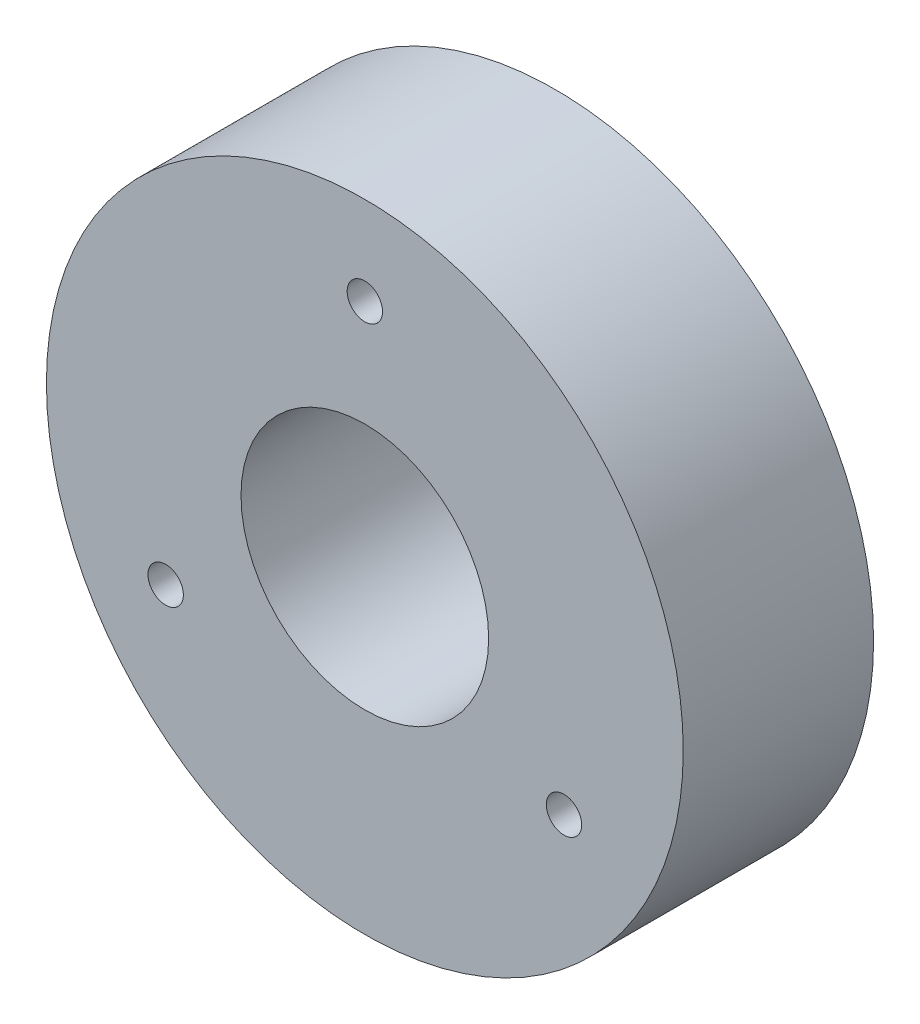
ISO-10303-21;
HEADER;
FILE_DESCRIPTION(('STEP AP214'),'2;1');
FILE_NAME('part.step','',(''),(''),'','','');
FILE_SCHEMA(('AUTOMOTIVE_DESIGN { 1 0 10303 214 1 1 1 1 }'));
ENDSEC;
DATA;
#1=APPLICATION_CONTEXT('core data for automotive mechanical design processes');
#2=APPLICATION_PROTOCOL_DEFINITION('international standard','automotive_design',2000,#1);
#3=PRODUCT_CONTEXT('',#1,'mechanical');
#4=PRODUCT('Part','Part','',(#3));
#5=PRODUCT_RELATED_PRODUCT_CATEGORY('part','',(#4));
#6=PRODUCT_DEFINITION_FORMATION('','',#4);
#7=PRODUCT_DEFINITION_CONTEXT('part definition',#1,'design');
#8=PRODUCT_DEFINITION('design','',#6,#7);
#9=PRODUCT_DEFINITION_SHAPE('','',#8);
#10=(LENGTH_UNIT() NAMED_UNIT(*) SI_UNIT(.MILLI.,.METRE.));
#11=(NAMED_UNIT(*) PLANE_ANGLE_UNIT() SI_UNIT($,.RADIAN.));
#12=(NAMED_UNIT(*) SI_UNIT($,.STERADIAN.) SOLID_ANGLE_UNIT());
#13=UNCERTAINTY_MEASURE_WITH_UNIT(LENGTH_MEASURE(1.E-05),#10,'distance_accuracy_value','');
#14=(GEOMETRIC_REPRESENTATION_CONTEXT(3) GLOBAL_UNCERTAINTY_ASSIGNED_CONTEXT((#13)) GLOBAL_UNIT_ASSIGNED_CONTEXT((#10,
#11,#12)) REPRESENTATION_CONTEXT('',''));
#15=CARTESIAN_POINT('',(0.,0.,0.));
#16=DIRECTION('',(0.,0.,1.));
#17=DIRECTION('',(1.,0.,0.));
#18=AXIS2_PLACEMENT_3D('',#15,#16,#17);
#19=CARTESIAN_POINT('',(0.,0.,-26.9));
#20=DIRECTION('',(0.,0.,1.));
#21=DIRECTION('',(1.,0.,0.));
#22=AXIS2_PLACEMENT_3D('',#19,#20,#21);
#23=CYLINDRICAL_SURFACE('',#22,5.);
#24=CARTESIAN_POINT('',(0.,0.,-26.9));
#25=DIRECTION('',(0.,0.,1.));
#26=DIRECTION('',(1.,0.,0.));
#27=AXIS2_PLACEMENT_3D('',#24,#25,#26);
#28=CIRCLE('',#27,5.);
#29=CARTESIAN_POINT('',(5.,0.,-26.9));
#30=VERTEX_POINT('',#29);
#31=EDGE_CURVE('E11',#30,#30,#28,.T.);
#32=ORIENTED_EDGE('',*,*,#31,.T.);
#33=EDGE_LOOP('',(#32));
#34=FACE_BOUND('',#33,.T.);
#35=CARTESIAN_POINT('',(0.,0.,-3.2));
#36=DIRECTION('',(0.,0.,1.));
#37=DIRECTION('',(1.,0.,0.));
#38=AXIS2_PLACEMENT_3D('',#35,#36,#37);
#39=CIRCLE('',#38,5.);
#40=CARTESIAN_POINT('',(5.,0.,-3.2));
#41=VERTEX_POINT('',#40);
#42=EDGE_CURVE('E59',#41,#41,#39,.T.);
#43=ORIENTED_EDGE('',*,*,#42,.F.);
#44=EDGE_LOOP('',(#43));
#45=FACE_BOUND('',#44,.T.);
#46=ADVANCED_FACE('F49',(#34,#45),#23,.T.);
#47=CARTESIAN_POINT('',(0.,0.,-26.9));
#48=DIRECTION('',(0.,0.,1.));
#49=DIRECTION('',(1.,0.,0.));
#50=AXIS2_PLACEMENT_3D('',#47,#48,#49);
#51=PLANE('',#50);
#52=ORIENTED_EDGE('',*,*,#31,.F.);
#53=EDGE_LOOP('',(#52));
#54=FACE_BOUND('',#53,.T.);
#55=ADVANCED_FACE('F74',(#54),#51,.F.);
#56=CARTESIAN_POINT('',(0.,0.,-3.2));
#57=DIRECTION('',(0.,0.,1.));
#58=DIRECTION('',(1.,0.,0.));
#59=AXIS2_PLACEMENT_3D('',#56,#57,#58);
#60=CYLINDRICAL_SURFACE('',#59,17.5);
#61=CARTESIAN_POINT('',(0.,0.,-3.2));
#62=DIRECTION('',(0.,0.,1.));
#63=DIRECTION('',(1.,0.,0.));
#64=AXIS2_PLACEMENT_3D('',#61,#62,#63);
#65=CIRCLE('',#64,17.5);
#66=CARTESIAN_POINT('',(17.5,0.,-3.2));
#67=VERTEX_POINT('',#66);
#68=EDGE_CURVE('E55',#67,#67,#65,.T.);
#69=ORIENTED_EDGE('',*,*,#68,.T.);
#70=EDGE_LOOP('',(#69));
#71=FACE_BOUND('',#70,.T.);
#72=CARTESIAN_POINT('',(0.,0.,0.));
#73=DIRECTION('',(0.,0.,1.));
#74=DIRECTION('',(1.,0.,0.));
#75=AXIS2_PLACEMENT_3D('',#72,#73,#74);
#76=CIRCLE('',#75,17.5);
#77=CARTESIAN_POINT('',(17.5,0.,0.));
#78=VERTEX_POINT('',#77);
#79=EDGE_CURVE('E64',#78,#78,#76,.T.);
#80=ORIENTED_EDGE('',*,*,#79,.F.);
#81=EDGE_LOOP('',(#80));
#82=FACE_BOUND('',#81,.T.);
#83=ADVANCED_FACE('F71',(#71,#82),#60,.T.);
#84=CARTESIAN_POINT('',(0.,0.,-3.2));
#85=DIRECTION('',(0.,0.,1.));
#86=DIRECTION('',(1.,0.,0.));
#87=AXIS2_PLACEMENT_3D('',#84,#85,#86);
#88=PLANE('',#87);
#89=ORIENTED_EDGE('',*,*,#42,.T.);
#90=EDGE_LOOP('',(#89));
#91=FACE_BOUND('',#90,.T.);
#92=ORIENTED_EDGE('',*,*,#68,.F.);
#93=EDGE_LOOP('',(#92));
#94=FACE_BOUND('',#93,.T.);
#95=ADVANCED_FACE('F73',(#91,#94),#88,.F.);
#96=CARTESIAN_POINT('',(0.,0.,0.));
#97=DIRECTION('',(0.,0.,1.));
#98=DIRECTION('',(1.,0.,0.));
#99=AXIS2_PLACEMENT_3D('',#96,#97,#98);
#100=PLANE('',#99);
#101=ORIENTED_EDGE('',*,*,#79,.T.);
#102=EDGE_LOOP('',(#101));
#103=FACE_BOUND('',#102,.T.);
#104=ADVANCED_FACE('F69',(#103),#100,.T.);
#105=CLOSED_SHELL('',(#46,#55,#83,#95,#104));
#106=MANIFOLD_SOLID_BREP('B2',#105);
#107=CARTESIAN_POINT('',(0.,0.,26.9));
#108=DIRECTION('',(0.,0.,-1.));
#109=DIRECTION('',(-1.,0.,0.));
#110=AXIS2_PLACEMENT_3D('',#107,#108,#109);
#111=CYLINDRICAL_SURFACE('',#110,17.5);
#112=CARTESIAN_POINT('',(0.,0.,26.9));
#113=DIRECTION('',(0.,0.,1.));
#114=DIRECTION('',(1.,0.,0.));
#115=AXIS2_PLACEMENT_3D('',#112,#113,#114);
#116=CIRCLE('',#115,17.5);
#117=CARTESIAN_POINT('',(17.5,0.,26.9));
#118=VERTEX_POINT('',#117);
#119=EDGE_CURVE('E136',#118,#118,#116,.T.);
#120=ORIENTED_EDGE('',*,*,#119,.T.);
#121=EDGE_LOOP('',(#120));
#122=FACE_BOUND('',#121,.T.);
#123=CARTESIAN_POINT('',(0.,0.,0.));
#124=DIRECTION('',(0.,0.,1.));
#125=DIRECTION('',(1.,0.,0.));
#126=AXIS2_PLACEMENT_3D('',#123,#124,#125);
#127=CIRCLE('',#126,17.5);
#128=CARTESIAN_POINT('',(17.5,0.,0.));
#129=VERTEX_POINT('',#128);
#130=EDGE_CURVE('E153',#129,#129,#127,.T.);
#131=ORIENTED_EDGE('',*,*,#130,.F.);
#132=EDGE_LOOP('',(#131));
#133=FACE_BOUND('',#132,.T.);
#134=ADVANCED_FACE('F127',(#122,#133),#111,.F.);
#135=CARTESIAN_POINT('',(0.,32.5,26.9));
#136=DIRECTION('',(0.,0.,-1.));
#137=DIRECTION('',(-1.,0.,0.));
#138=AXIS2_PLACEMENT_3D('',#135,#136,#137);
#139=CYLINDRICAL_SURFACE('',#138,2.5);
#140=CARTESIAN_POINT('',(0.,32.5,26.9));
#141=DIRECTION('',(0.,0.,1.));
#142=DIRECTION('',(1.,0.,0.));
#143=AXIS2_PLACEMENT_3D('',#140,#141,#142);
#144=CIRCLE('',#143,2.5);
#145=CARTESIAN_POINT('',(2.5,32.5,26.9));
#146=VERTEX_POINT('',#145);
#147=EDGE_CURVE('E141',#146,#146,#144,.T.);
#148=ORIENTED_EDGE('',*,*,#147,.T.);
#149=EDGE_LOOP('',(#148));
#150=FACE_BOUND('',#149,.T.);
#151=CARTESIAN_POINT('',(0.,32.5,0.));
#152=DIRECTION('',(0.,0.,1.));
#153=DIRECTION('',(1.,0.,0.));
#154=AXIS2_PLACEMENT_3D('',#151,#152,#153);
#155=CIRCLE('',#154,2.5);
#156=CARTESIAN_POINT('',(2.5,32.5,0.));
#157=VERTEX_POINT('',#156);
#158=EDGE_CURVE('E151',#157,#157,#155,.T.);
#159=ORIENTED_EDGE('',*,*,#158,.F.);
#160=EDGE_LOOP('',(#159));
#161=FACE_BOUND('',#160,.T.);
#162=ADVANCED_FACE('F171',(#150,#161),#139,.F.);
#163=CARTESIAN_POINT('',(28.1458256229955,-16.2499999999993,26.9));
#164=DIRECTION('',(0.,0.,-1.));
#165=DIRECTION('',(-1.,0.,0.));
#166=AXIS2_PLACEMENT_3D('',#163,#164,#165);
#167=CYLINDRICAL_SURFACE('',#166,2.5);
#168=CARTESIAN_POINT('',(28.1458256229955,-16.2499999999993,26.9));
#169=DIRECTION('',(0.,0.,1.));
#170=DIRECTION('',(1.,0.,0.));
#171=AXIS2_PLACEMENT_3D('',#168,#169,#170);
#172=CIRCLE('',#171,2.5);
#173=CARTESIAN_POINT('',(30.6458256229955,-16.2499999999993,26.9));
#174=VERTEX_POINT('',#173);
#175=EDGE_CURVE('E162',#174,#174,#172,.T.);
#176=ORIENTED_EDGE('',*,*,#175,.T.);
#177=EDGE_LOOP('',(#176));
#178=FACE_BOUND('',#177,.T.);
#179=CARTESIAN_POINT('',(28.1458256229955,-16.2499999999993,0.));
#180=DIRECTION('',(0.,0.,1.));
#181=DIRECTION('',(1.,0.,0.));
#182=AXIS2_PLACEMENT_3D('',#179,#180,#181);
#183=CIRCLE('',#182,2.5);
#184=CARTESIAN_POINT('',(30.6458256229955,-16.2499999999993,0.));
#185=VERTEX_POINT('',#184);
#186=EDGE_CURVE('E148',#185,#185,#183,.T.);
#187=ORIENTED_EDGE('',*,*,#186,.F.);
#188=EDGE_LOOP('',(#187));
#189=FACE_BOUND('',#188,.T.);
#190=ADVANCED_FACE('F188',(#178,#189),#167,.F.);
#191=CARTESIAN_POINT('',(-28.1458256229931,-16.2500000000007,26.9));
#192=DIRECTION('',(0.,0.,-1.));
#193=DIRECTION('',(-1.,0.,0.));
#194=AXIS2_PLACEMENT_3D('',#191,#192,#193);
#195=CYLINDRICAL_SURFACE('',#194,2.5);
#196=CARTESIAN_POINT('',(-28.1458256229931,-16.2500000000007,26.9));
#197=DIRECTION('',(0.,0.,1.));
#198=DIRECTION('',(1.,0.,0.));
#199=AXIS2_PLACEMENT_3D('',#196,#197,#198);
#200=CIRCLE('',#199,2.5);
#201=CARTESIAN_POINT('',(-25.6458256229931,-16.2500000000007,26.9));
#202=VERTEX_POINT('',#201);
#203=EDGE_CURVE('E158',#202,#202,#200,.T.);
#204=ORIENTED_EDGE('',*,*,#203,.T.);
#205=EDGE_LOOP('',(#204));
#206=FACE_BOUND('',#205,.T.);
#207=CARTESIAN_POINT('',(-28.1458256229931,-16.2500000000007,0.));
#208=DIRECTION('',(0.,0.,1.));
#209=DIRECTION('',(1.,0.,0.));
#210=AXIS2_PLACEMENT_3D('',#207,#208,#209);
#211=CIRCLE('',#210,2.5);
#212=CARTESIAN_POINT('',(-25.6458256229931,-16.2500000000007,0.));
#213=VERTEX_POINT('',#212);
#214=EDGE_CURVE('E145',#213,#213,#211,.T.);
#215=ORIENTED_EDGE('',*,*,#214,.F.);
#216=EDGE_LOOP('',(#215));
#217=FACE_BOUND('',#216,.T.);
#218=ADVANCED_FACE('F129',(#206,#217),#195,.F.);
#219=CARTESIAN_POINT('',(0.,0.,26.9));
#220=DIRECTION('',(0.,0.,-1.));
#221=DIRECTION('',(-1.,0.,0.));
#222=AXIS2_PLACEMENT_3D('',#219,#220,#221);
#223=CYLINDRICAL_SURFACE('',#222,45.);
#224=CARTESIAN_POINT('',(0.,0.,26.9));
#225=DIRECTION('',(0.,0.,1.));
#226=DIRECTION('',(1.,0.,0.));
#227=AXIS2_PLACEMENT_3D('',#224,#225,#226);
#228=CIRCLE('',#227,45.);
#229=CARTESIAN_POINT('',(45.,0.,26.9));
#230=VERTEX_POINT('',#229);
#231=EDGE_CURVE('E48',#230,#230,#228,.T.);
#232=ORIENTED_EDGE('',*,*,#231,.F.);
#233=EDGE_LOOP('',(#232));
#234=FACE_BOUND('',#233,.T.);
#235=CARTESIAN_POINT('',(0.,0.,0.));
#236=DIRECTION('',(0.,0.,1.));
#237=DIRECTION('',(1.,0.,0.));
#238=AXIS2_PLACEMENT_3D('',#235,#236,#237);
#239=CIRCLE('',#238,45.);
#240=CARTESIAN_POINT('',(45.,0.,0.));
#241=VERTEX_POINT('',#240);
#242=EDGE_CURVE('E131',#241,#241,#239,.T.);
#243=ORIENTED_EDGE('',*,*,#242,.T.);
#244=EDGE_LOOP('',(#243));
#245=FACE_BOUND('',#244,.T.);
#246=ADVANCED_FACE('F178',(#234,#245),#223,.T.);
#247=CARTESIAN_POINT('',(0.,0.,26.9));
#248=DIRECTION('',(0.,0.,1.));
#249=DIRECTION('',(1.,0.,0.));
#250=AXIS2_PLACEMENT_3D('',#247,#248,#249);
#251=PLANE('',#250);
#252=ORIENTED_EDGE('',*,*,#203,.F.);
#253=EDGE_LOOP('',(#252));
#254=FACE_BOUND('',#253,.T.);
#255=ORIENTED_EDGE('',*,*,#175,.F.);
#256=EDGE_LOOP('',(#255));
#257=FACE_BOUND('',#256,.T.);
#258=ORIENTED_EDGE('',*,*,#147,.F.);
#259=EDGE_LOOP('',(#258));
#260=FACE_BOUND('',#259,.T.);
#261=ORIENTED_EDGE('',*,*,#119,.F.);
#262=EDGE_LOOP('',(#261));
#263=FACE_BOUND('',#262,.T.);
#264=ORIENTED_EDGE('',*,*,#231,.T.);
#265=EDGE_LOOP('',(#264));
#266=FACE_BOUND('',#265,.T.);
#267=ADVANCED_FACE('F174',(#254,#257,#260,#263,#266),#251,.T.);
#268=CARTESIAN_POINT('',(0.,0.,0.));
#269=DIRECTION('',(0.,0.,1.));
#270=DIRECTION('',(1.,0.,0.));
#271=AXIS2_PLACEMENT_3D('',#268,#269,#270);
#272=PLANE('',#271);
#273=ORIENTED_EDGE('',*,*,#214,.T.);
#274=EDGE_LOOP('',(#273));
#275=FACE_BOUND('',#274,.T.);
#276=ORIENTED_EDGE('',*,*,#186,.T.);
#277=EDGE_LOOP('',(#276));
#278=FACE_BOUND('',#277,.T.);
#279=ORIENTED_EDGE('',*,*,#158,.T.);
#280=EDGE_LOOP('',(#279));
#281=FACE_BOUND('',#280,.T.);
#282=ORIENTED_EDGE('',*,*,#130,.T.);
#283=EDGE_LOOP('',(#282));
#284=FACE_BOUND('',#283,.T.);
#285=ORIENTED_EDGE('',*,*,#242,.F.);
#286=EDGE_LOOP('',(#285));
#287=FACE_BOUND('',#286,.T.);
#288=ADVANCED_FACE('F177',(#275,#278,#281,#284,#287),#272,.F.);
#289=CLOSED_SHELL('',(#134,#162,#190,#218,#246,#267,#288));
#290=MANIFOLD_SOLID_BREP('B6',#289);
#291=ADVANCED_BREP_SHAPE_REPRESENTATION('',(#18,#106,#290),#14);
#292=SHAPE_DEFINITION_REPRESENTATION(#9,#291);
ENDSEC;
END-ISO-10303-21;
